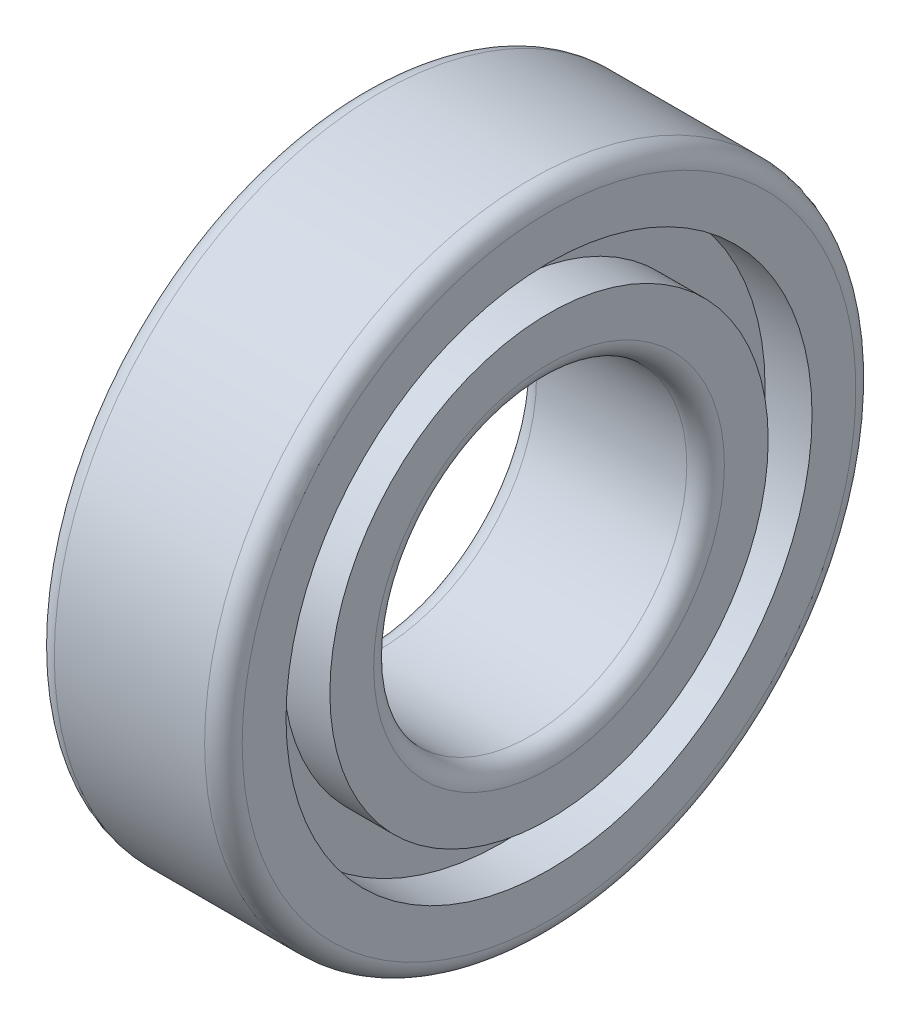
ISO-10303-21;
HEADER;
FILE_DESCRIPTION(('STEP AP214'),'2;1');
FILE_NAME('part.step','',(''),(''),'','','');
FILE_SCHEMA(('AUTOMOTIVE_DESIGN { 1 0 10303 214 1 1 1 1 }'));
ENDSEC;
DATA;
#1=APPLICATION_CONTEXT('core data for automotive mechanical design processes');
#2=APPLICATION_PROTOCOL_DEFINITION('international standard','automotive_design',2000,#1);
#3=PRODUCT_CONTEXT('',#1,'mechanical');
#4=PRODUCT('Part','Part','',(#3));
#5=PRODUCT_RELATED_PRODUCT_CATEGORY('part','',(#4));
#6=PRODUCT_DEFINITION_FORMATION('','',#4);
#7=PRODUCT_DEFINITION_CONTEXT('part definition',#1,'design');
#8=PRODUCT_DEFINITION('design','',#6,#7);
#9=PRODUCT_DEFINITION_SHAPE('','',#8);
#10=(LENGTH_UNIT() NAMED_UNIT(*) SI_UNIT(.MILLI.,.METRE.));
#11=(NAMED_UNIT(*) PLANE_ANGLE_UNIT() SI_UNIT($,.RADIAN.));
#12=(NAMED_UNIT(*) SI_UNIT($,.STERADIAN.) SOLID_ANGLE_UNIT());
#13=UNCERTAINTY_MEASURE_WITH_UNIT(LENGTH_MEASURE(1.E-05),#10,'distance_accuracy_value','');
#14=(GEOMETRIC_REPRESENTATION_CONTEXT(3) GLOBAL_UNCERTAINTY_ASSIGNED_CONTEXT((#13)) GLOBAL_UNIT_ASSIGNED_CONTEXT((#10,
#11,#12)) REPRESENTATION_CONTEXT('',''));
#15=CARTESIAN_POINT('',(0.,0.,0.));
#16=DIRECTION('',(0.,0.,1.));
#17=DIRECTION('',(1.,0.,0.));
#18=AXIS2_PLACEMENT_3D('',#15,#16,#17);
#19=CARTESIAN_POINT('',(-873.991742101089,0.,0.));
#20=DIRECTION('',(-1.,0.,0.));
#21=DIRECTION('',(0.,0.,1.));
#22=AXIS2_PLACEMENT_3D('',#19,#20,#21);
#23=CYLINDRICAL_SURFACE('',#22,17.5);
#24=CARTESIAN_POINT('',(-7.49999999999995,0.,0.));
#25=DIRECTION('',(-1.,0.,0.));
#26=DIRECTION('',(0.,0.,1.));
#27=AXIS2_PLACEMENT_3D('',#24,#25,#26);
#28=CIRCLE('',#27,17.5);
#29=CARTESIAN_POINT('',(-7.49999999999995,0.,17.5));
#30=VERTEX_POINT('',#29);
#31=EDGE_CURVE('E84',#30,#30,#28,.T.);
#32=ORIENTED_EDGE('',*,*,#31,.F.);
#33=EDGE_LOOP('',(#32));
#34=FACE_BOUND('',#33,.T.);
#35=CARTESIAN_POINT('',(-3.75000000000003,0.,0.));
#36=DIRECTION('',(-1.,0.,0.));
#37=DIRECTION('',(0.,0.,1.));
#38=AXIS2_PLACEMENT_3D('',#35,#36,#37);
#39=CIRCLE('',#38,17.5);
#40=CARTESIAN_POINT('',(-3.75000000000003,0.,17.5));
#41=VERTEX_POINT('',#40);
#42=EDGE_CURVE('E10',#41,#41,#39,.T.);
#43=ORIENTED_EDGE('',*,*,#42,.T.);
#44=EDGE_LOOP('',(#43));
#45=FACE_BOUND('',#44,.T.);
#46=ADVANCED_FACE('F32',(#34,#45),#23,.T.);
#47=CARTESIAN_POINT('',(-3.75,17.5,0.));
#48=DIRECTION('',(1.,0.,0.));
#49=DIRECTION('',(0.,0.,-1.));
#50=AXIS2_PLACEMENT_3D('',#47,#48,#49);
#51=PLANE('',#50);
#52=ORIENTED_EDGE('',*,*,#42,.F.);
#53=EDGE_LOOP('',(#52));
#54=FACE_BOUND('',#53,.T.);
#55=CARTESIAN_POINT('',(-3.75000000000003,0.,0.));
#56=DIRECTION('',(-1.,0.,0.));
#57=DIRECTION('',(0.,0.,1.));
#58=AXIS2_PLACEMENT_3D('',#55,#56,#57);
#59=CIRCLE('',#58,21.);
#60=CARTESIAN_POINT('',(-3.75000000000003,0.,21.));
#61=VERTEX_POINT('',#60);
#62=EDGE_CURVE('E38',#61,#61,#59,.T.);
#63=ORIENTED_EDGE('',*,*,#62,.T.);
#64=EDGE_LOOP('',(#63));
#65=FACE_BOUND('',#64,.T.);
#66=ADVANCED_FACE('F91',(#54,#65),#51,.F.);
#67=CARTESIAN_POINT('',(-873.991742101089,0.,0.));
#68=DIRECTION('',(-1.,0.,0.));
#69=DIRECTION('',(0.,0.,1.));
#70=AXIS2_PLACEMENT_3D('',#67,#68,#69);
#71=CYLINDRICAL_SURFACE('',#70,21.);
#72=ORIENTED_EDGE('',*,*,#62,.F.);
#73=EDGE_LOOP('',(#72));
#74=FACE_BOUND('',#73,.T.);
#75=CARTESIAN_POINT('',(-7.49999999999995,0.,0.));
#76=DIRECTION('',(-1.,0.,0.));
#77=DIRECTION('',(0.,0.,1.));
#78=AXIS2_PLACEMENT_3D('',#75,#76,#77);
#79=CIRCLE('',#78,21.);
#80=CARTESIAN_POINT('',(-7.49999999999995,0.,21.));
#81=VERTEX_POINT('',#80);
#82=EDGE_CURVE('E42',#81,#81,#79,.T.);
#83=ORIENTED_EDGE('',*,*,#82,.T.);
#84=EDGE_LOOP('',(#83));
#85=FACE_BOUND('',#84,.T.);
#86=ADVANCED_FACE('F95',(#74,#85),#71,.F.);
#87=CARTESIAN_POINT('',(-7.5,21.,0.));
#88=DIRECTION('',(1.,0.,0.));
#89=DIRECTION('',(0.,0.,-1.));
#90=AXIS2_PLACEMENT_3D('',#87,#88,#89);
#91=PLANE('',#90);
#92=ORIENTED_EDGE('',*,*,#82,.F.);
#93=EDGE_LOOP('',(#92));
#94=FACE_BOUND('',#93,.T.);
#95=CARTESIAN_POINT('',(-7.49999999999995,0.,0.));
#96=DIRECTION('',(-1.,0.,0.));
#97=DIRECTION('',(0.,0.,1.));
#98=AXIS2_PLACEMENT_3D('',#95,#96,#97);
#99=CIRCLE('',#98,24.5);
#100=CARTESIAN_POINT('',(-7.49999999999995,0.,24.5));
#101=VERTEX_POINT('',#100);
#102=EDGE_CURVE('E46',#101,#101,#99,.T.);
#103=ORIENTED_EDGE('',*,*,#102,.T.);
#104=EDGE_LOOP('',(#103));
#105=FACE_BOUND('',#104,.T.);
#106=ADVANCED_FACE('F100',(#94,#105),#91,.F.);
#107=CARTESIAN_POINT('',(-6.,0.,0.));
#108=DIRECTION('',(-1.,0.,0.));
#109=DIRECTION('',(0.,0.,1.));
#110=AXIS2_PLACEMENT_3D('',#107,#108,#109);
#111=TOROIDAL_SURFACE('',#110,24.5,1.5);
#112=ORIENTED_EDGE('',*,*,#102,.F.);
#113=EDGE_LOOP('',(#112));
#114=FACE_BOUND('',#113,.T.);
#115=CARTESIAN_POINT('',(-6.00000000000001,0.,0.));
#116=DIRECTION('',(-1.,0.,0.));
#117=DIRECTION('',(0.,0.,1.));
#118=AXIS2_PLACEMENT_3D('',#115,#116,#117);
#119=CIRCLE('',#118,26.);
#120=CARTESIAN_POINT('',(-6.00000000000001,0.,26.));
#121=VERTEX_POINT('',#120);
#122=EDGE_CURVE('E51',#121,#121,#119,.T.);
#123=ORIENTED_EDGE('',*,*,#122,.T.);
#124=EDGE_LOOP('',(#123));
#125=FACE_BOUND('',#124,.T.);
#126=ADVANCED_FACE('F106',(#114,#125),#111,.T.);
#127=CARTESIAN_POINT('',(-873.991742101089,0.,0.));
#128=DIRECTION('',(-1.,0.,0.));
#129=DIRECTION('',(0.,0.,1.));
#130=AXIS2_PLACEMENT_3D('',#127,#128,#129);
#131=CYLINDRICAL_SURFACE('',#130,26.);
#132=ORIENTED_EDGE('',*,*,#122,.F.);
#133=EDGE_LOOP('',(#132));
#134=FACE_BOUND('',#133,.T.);
#135=CARTESIAN_POINT('',(6.00000000000001,0.,0.));
#136=DIRECTION('',(-1.,0.,0.));
#137=DIRECTION('',(0.,0.,1.));
#138=AXIS2_PLACEMENT_3D('',#135,#136,#137);
#139=CIRCLE('',#138,26.);
#140=CARTESIAN_POINT('',(6.00000000000001,0.,26.));
#141=VERTEX_POINT('',#140);
#142=EDGE_CURVE('E54',#141,#141,#139,.T.);
#143=ORIENTED_EDGE('',*,*,#142,.T.);
#144=EDGE_LOOP('',(#143));
#145=FACE_BOUND('',#144,.T.);
#146=ADVANCED_FACE('F110',(#134,#145),#131,.T.);
#147=CARTESIAN_POINT('',(6.,0.,0.));
#148=DIRECTION('',(-1.,0.,0.));
#149=DIRECTION('',(0.,0.,1.));
#150=AXIS2_PLACEMENT_3D('',#147,#148,#149);
#151=TOROIDAL_SURFACE('',#150,24.5,1.5);
#152=ORIENTED_EDGE('',*,*,#142,.F.);
#153=EDGE_LOOP('',(#152));
#154=FACE_BOUND('',#153,.T.);
#155=CARTESIAN_POINT('',(7.49999999999995,0.,0.));
#156=DIRECTION('',(-1.,0.,0.));
#157=DIRECTION('',(0.,0.,1.));
#158=AXIS2_PLACEMENT_3D('',#155,#156,#157);
#159=CIRCLE('',#158,24.5);
#160=CARTESIAN_POINT('',(7.49999999999995,0.,24.5));
#161=VERTEX_POINT('',#160);
#162=EDGE_CURVE('E57',#161,#161,#159,.T.);
#163=ORIENTED_EDGE('',*,*,#162,.T.);
#164=EDGE_LOOP('',(#163));
#165=FACE_BOUND('',#164,.T.);
#166=ADVANCED_FACE('F114',(#154,#165),#151,.T.);
#167=CARTESIAN_POINT('',(7.5,21.,0.));
#168=DIRECTION('',(-1.,0.,0.));
#169=DIRECTION('',(0.,0.,1.));
#170=AXIS2_PLACEMENT_3D('',#167,#168,#169);
#171=PLANE('',#170);
#172=ORIENTED_EDGE('',*,*,#162,.F.);
#173=EDGE_LOOP('',(#172));
#174=FACE_BOUND('',#173,.T.);
#175=CARTESIAN_POINT('',(7.49999999999995,0.,0.));
#176=DIRECTION('',(-1.,0.,0.));
#177=DIRECTION('',(0.,0.,1.));
#178=AXIS2_PLACEMENT_3D('',#175,#176,#177);
#179=CIRCLE('',#178,21.);
#180=CARTESIAN_POINT('',(7.49999999999995,0.,21.));
#181=VERTEX_POINT('',#180);
#182=EDGE_CURVE('E60',#181,#181,#179,.T.);
#183=ORIENTED_EDGE('',*,*,#182,.T.);
#184=EDGE_LOOP('',(#183));
#185=FACE_BOUND('',#184,.T.);
#186=ADVANCED_FACE('F118',(#174,#185),#171,.F.);
#187=CARTESIAN_POINT('',(-873.991742101089,0.,0.));
#188=DIRECTION('',(-1.,0.,0.));
#189=DIRECTION('',(0.,0.,1.));
#190=AXIS2_PLACEMENT_3D('',#187,#188,#189);
#191=CYLINDRICAL_SURFACE('',#190,21.);
#192=ORIENTED_EDGE('',*,*,#182,.F.);
#193=EDGE_LOOP('',(#192));
#194=FACE_BOUND('',#193,.T.);
#195=CARTESIAN_POINT('',(3.75000000000003,0.,0.));
#196=DIRECTION('',(-1.,0.,0.));
#197=DIRECTION('',(0.,0.,1.));
#198=AXIS2_PLACEMENT_3D('',#195,#196,#197);
#199=CIRCLE('',#198,21.);
#200=CARTESIAN_POINT('',(3.75000000000003,0.,21.));
#201=VERTEX_POINT('',#200);
#202=EDGE_CURVE('E63',#201,#201,#199,.T.);
#203=ORIENTED_EDGE('',*,*,#202,.T.);
#204=EDGE_LOOP('',(#203));
#205=FACE_BOUND('',#204,.T.);
#206=ADVANCED_FACE('F122',(#194,#205),#191,.F.);
#207=CARTESIAN_POINT('',(3.75,17.5,0.));
#208=DIRECTION('',(-1.,0.,0.));
#209=DIRECTION('',(0.,0.,1.));
#210=AXIS2_PLACEMENT_3D('',#207,#208,#209);
#211=PLANE('',#210);
#212=ORIENTED_EDGE('',*,*,#202,.F.);
#213=EDGE_LOOP('',(#212));
#214=FACE_BOUND('',#213,.T.);
#215=CARTESIAN_POINT('',(3.75000000000003,0.,0.));
#216=DIRECTION('',(-1.,0.,0.));
#217=DIRECTION('',(0.,0.,1.));
#218=AXIS2_PLACEMENT_3D('',#215,#216,#217);
#219=CIRCLE('',#218,17.5);
#220=CARTESIAN_POINT('',(3.75000000000003,0.,17.5));
#221=VERTEX_POINT('',#220);
#222=EDGE_CURVE('E66',#221,#221,#219,.T.);
#223=ORIENTED_EDGE('',*,*,#222,.T.);
#224=EDGE_LOOP('',(#223));
#225=FACE_BOUND('',#224,.T.);
#226=ADVANCED_FACE('F126',(#214,#225),#211,.F.);
#227=CARTESIAN_POINT('',(-873.991742101089,0.,0.));
#228=DIRECTION('',(-1.,0.,0.));
#229=DIRECTION('',(0.,0.,1.));
#230=AXIS2_PLACEMENT_3D('',#227,#228,#229);
#231=CYLINDRICAL_SURFACE('',#230,17.5);
#232=ORIENTED_EDGE('',*,*,#222,.F.);
#233=EDGE_LOOP('',(#232));
#234=FACE_BOUND('',#233,.T.);
#235=CARTESIAN_POINT('',(7.49999999999995,0.,0.));
#236=DIRECTION('',(-1.,0.,0.));
#237=DIRECTION('',(0.,0.,1.));
#238=AXIS2_PLACEMENT_3D('',#235,#236,#237);
#239=CIRCLE('',#238,17.5);
#240=CARTESIAN_POINT('',(7.49999999999995,0.,17.5));
#241=VERTEX_POINT('',#240);
#242=EDGE_CURVE('E69',#241,#241,#239,.T.);
#243=ORIENTED_EDGE('',*,*,#242,.T.);
#244=EDGE_LOOP('',(#243));
#245=FACE_BOUND('',#244,.T.);
#246=ADVANCED_FACE('F130',(#234,#245),#231,.T.);
#247=CARTESIAN_POINT('',(7.5,14.,0.));
#248=DIRECTION('',(-1.,0.,0.));
#249=DIRECTION('',(0.,0.,1.));
#250=AXIS2_PLACEMENT_3D('',#247,#248,#249);
#251=PLANE('',#250);
#252=ORIENTED_EDGE('',*,*,#242,.F.);
#253=EDGE_LOOP('',(#252));
#254=FACE_BOUND('',#253,.T.);
#255=CARTESIAN_POINT('',(7.49999999999995,0.,0.));
#256=DIRECTION('',(-1.,0.,0.));
#257=DIRECTION('',(0.,0.,1.));
#258=AXIS2_PLACEMENT_3D('',#255,#256,#257);
#259=CIRCLE('',#258,14.);
#260=CARTESIAN_POINT('',(7.49999999999995,0.,14.));
#261=VERTEX_POINT('',#260);
#262=EDGE_CURVE('E72',#261,#261,#259,.T.);
#263=ORIENTED_EDGE('',*,*,#262,.T.);
#264=EDGE_LOOP('',(#263));
#265=FACE_BOUND('',#264,.T.);
#266=ADVANCED_FACE('F134',(#254,#265),#251,.F.);
#267=CARTESIAN_POINT('',(6.,0.,0.));
#268=DIRECTION('',(-1.,0.,0.));
#269=DIRECTION('',(0.,0.,1.));
#270=AXIS2_PLACEMENT_3D('',#267,#268,#269);
#271=TOROIDAL_SURFACE('',#270,14.,1.5);
#272=ORIENTED_EDGE('',*,*,#262,.F.);
#273=EDGE_LOOP('',(#272));
#274=FACE_BOUND('',#273,.T.);
#275=CARTESIAN_POINT('',(6.00000000000001,0.,0.));
#276=DIRECTION('',(-1.,0.,0.));
#277=DIRECTION('',(0.,0.,1.));
#278=AXIS2_PLACEMENT_3D('',#275,#276,#277);
#279=CIRCLE('',#278,12.5);
#280=CARTESIAN_POINT('',(6.00000000000001,0.,12.5));
#281=VERTEX_POINT('',#280);
#282=EDGE_CURVE('E75',#281,#281,#279,.T.);
#283=ORIENTED_EDGE('',*,*,#282,.T.);
#284=EDGE_LOOP('',(#283));
#285=FACE_BOUND('',#284,.T.);
#286=ADVANCED_FACE('F138',(#274,#285),#271,.T.);
#287=CARTESIAN_POINT('',(-873.991742101089,0.,0.));
#288=DIRECTION('',(-1.,0.,0.));
#289=DIRECTION('',(0.,0.,1.));
#290=AXIS2_PLACEMENT_3D('',#287,#288,#289);
#291=CYLINDRICAL_SURFACE('',#290,12.5);
#292=ORIENTED_EDGE('',*,*,#282,.F.);
#293=EDGE_LOOP('',(#292));
#294=FACE_BOUND('',#293,.T.);
#295=CARTESIAN_POINT('',(-6.00000000000001,0.,0.));
#296=DIRECTION('',(-1.,0.,0.));
#297=DIRECTION('',(0.,0.,1.));
#298=AXIS2_PLACEMENT_3D('',#295,#296,#297);
#299=CIRCLE('',#298,12.5);
#300=CARTESIAN_POINT('',(-6.00000000000001,0.,12.5));
#301=VERTEX_POINT('',#300);
#302=EDGE_CURVE('E78',#301,#301,#299,.T.);
#303=ORIENTED_EDGE('',*,*,#302,.T.);
#304=EDGE_LOOP('',(#303));
#305=FACE_BOUND('',#304,.T.);
#306=ADVANCED_FACE('F142',(#294,#305),#291,.F.);
#307=CARTESIAN_POINT('',(-6.,0.,0.));
#308=DIRECTION('',(-1.,0.,0.));
#309=DIRECTION('',(0.,0.,1.));
#310=AXIS2_PLACEMENT_3D('',#307,#308,#309);
#311=TOROIDAL_SURFACE('',#310,14.,1.5);
#312=ORIENTED_EDGE('',*,*,#302,.F.);
#313=EDGE_LOOP('',(#312));
#314=FACE_BOUND('',#313,.T.);
#315=CARTESIAN_POINT('',(-7.49999999999995,0.,0.));
#316=DIRECTION('',(-1.,0.,0.));
#317=DIRECTION('',(0.,0.,1.));
#318=AXIS2_PLACEMENT_3D('',#315,#316,#317);
#319=CIRCLE('',#318,14.);
#320=CARTESIAN_POINT('',(-7.49999999999995,0.,14.));
#321=VERTEX_POINT('',#320);
#322=EDGE_CURVE('E81',#321,#321,#319,.T.);
#323=ORIENTED_EDGE('',*,*,#322,.T.);
#324=EDGE_LOOP('',(#323));
#325=FACE_BOUND('',#324,.T.);
#326=ADVANCED_FACE('F146',(#314,#325),#311,.T.);
#327=CARTESIAN_POINT('',(-7.5,14.,0.));
#328=DIRECTION('',(1.,0.,0.));
#329=DIRECTION('',(0.,0.,-1.));
#330=AXIS2_PLACEMENT_3D('',#327,#328,#329);
#331=PLANE('',#330);
#332=ORIENTED_EDGE('',*,*,#322,.F.);
#333=EDGE_LOOP('',(#332));
#334=FACE_BOUND('',#333,.T.);
#335=ORIENTED_EDGE('',*,*,#31,.T.);
#336=EDGE_LOOP('',(#335));
#337=FACE_BOUND('',#336,.T.);
#338=ADVANCED_FACE('F88',(#334,#337),#331,.F.);
#339=CLOSED_SHELL('',(#46,#66,#86,#106,#126,#146,#166,#186,#206,#226,#246,#266,#286,#306,#326,#338));
#340=MANIFOLD_SOLID_BREP('B2',#339);
#341=ADVANCED_BREP_SHAPE_REPRESENTATION('',(#18,#340),#14);
#342=SHAPE_DEFINITION_REPRESENTATION(#9,#341);
ENDSEC;
END-ISO-10303-21;
